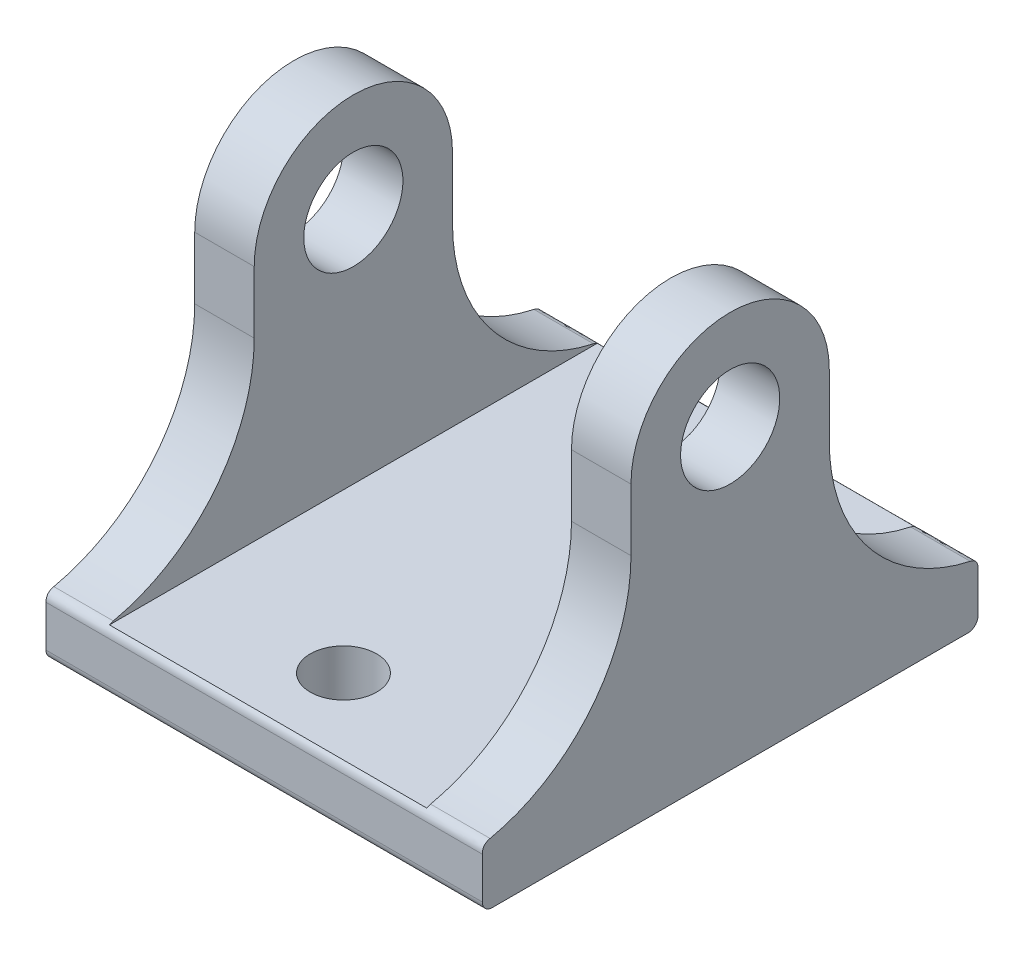
ISO-10303-21;
HEADER;
FILE_DESCRIPTION(('STEP AP214'),'2;1');
FILE_NAME('part.step','',(''),(''),'','','');
FILE_SCHEMA(('AUTOMOTIVE_DESIGN { 1 0 10303 214 1 1 1 1 }'));
ENDSEC;
DATA;
#1=APPLICATION_CONTEXT('core data for automotive mechanical design processes');
#2=APPLICATION_PROTOCOL_DEFINITION('international standard','automotive_design',2000,#1);
#3=PRODUCT_CONTEXT('',#1,'mechanical');
#4=PRODUCT('Part','Part','',(#3));
#5=PRODUCT_RELATED_PRODUCT_CATEGORY('part','',(#4));
#6=PRODUCT_DEFINITION_FORMATION('','',#4);
#7=PRODUCT_DEFINITION_CONTEXT('part definition',#1,'design');
#8=PRODUCT_DEFINITION('design','',#6,#7);
#9=PRODUCT_DEFINITION_SHAPE('','',#8);
#10=(LENGTH_UNIT() NAMED_UNIT(*) SI_UNIT(.MILLI.,.METRE.));
#11=(NAMED_UNIT(*) PLANE_ANGLE_UNIT() SI_UNIT($,.RADIAN.));
#12=(NAMED_UNIT(*) SI_UNIT($,.STERADIAN.) SOLID_ANGLE_UNIT());
#13=UNCERTAINTY_MEASURE_WITH_UNIT(LENGTH_MEASURE(1.E-05),#10,'distance_accuracy_value','');
#14=(GEOMETRIC_REPRESENTATION_CONTEXT(3) GLOBAL_UNCERTAINTY_ASSIGNED_CONTEXT((#13)) GLOBAL_UNIT_ASSIGNED_CONTEXT((#10,
#11,#12)) REPRESENTATION_CONTEXT('',''));
#15=CARTESIAN_POINT('',(0.,0.,0.));
#16=DIRECTION('',(0.,0.,1.));
#17=DIRECTION('',(1.,0.,0.));
#18=AXIS2_PLACEMENT_3D('',#15,#16,#17);
#19=CARTESIAN_POINT('',(22.,6.,25.));
#20=DIRECTION('',(-1.,0.,0.));
#21=DIRECTION('',(0.,0.,1.));
#22=AXIS2_PLACEMENT_3D('',#19,#20,#21);
#23=PLANE('',#22);
#24=CARTESIAN_POINT('',(22.,30.,0.));
#25=DIRECTION('',(-1.,0.,0.));
#26=DIRECTION('',(0.,0.,1.));
#27=AXIS2_PLACEMENT_3D('',#24,#25,#26);
#28=CIRCLE('',#27,5.);
#29=CARTESIAN_POINT('',(22.,30.,5.));
#30=VERTEX_POINT('',#29);
#31=EDGE_CURVE('E525',#30,#30,#28,.T.);
#32=ORIENTED_EDGE('',*,*,#31,.T.);
#33=EDGE_LOOP('',(#32));
#34=FACE_BOUND('',#33,.T.);
#35=DIRECTION('',(0.,-1.,0.));
#36=VECTOR('',#35,1.);
#37=CARTESIAN_POINT('',(22.,6.,-25.));
#38=LINE('',#37,#36);
#39=CARTESIAN_POINT('',(22.,5.17406372829214,-25.));
#40=VERTEX_POINT('',#39);
#41=CARTESIAN_POINT('',(22.,1.,-25.));
#42=VERTEX_POINT('',#41);
#43=EDGE_CURVE('E327',#40,#42,#38,.T.);
#44=ORIENTED_EDGE('',*,*,#43,.F.);
#45=CARTESIAN_POINT('',(22.,6.15165191887144,-24.2105263157895));
#46=CARTESIAN_POINT('',(22.,5.98163658137939,-25.));
#47=CARTESIAN_POINT('',(22.,5.17406372829214,-25.));
#48=(BOUNDED_CURVE() B_SPLINE_CURVE(2,(#45,#46,#47),.UNSPECIFIED.,.F.,
.F.) B_SPLINE_CURVE_WITH_KNOTS((3,3),(0.,1.),
.UNSPECIFIED.) CURVE() GEOMETRIC_REPRESENTATION_ITEM() RATIONAL_B_SPLINE_CURVE((1.,1.,1.)) REPRESENTATION_ITEM(''));
#49=CARTESIAN_POINT('',(22.,6.15165191887144,-24.2105263157895));
#50=VERTEX_POINT('',#49);
#51=EDGE_CURVE('E526',#40,#50,#48,.F.);
#52=ORIENTED_EDGE('',*,*,#51,.T.);
#53=CARTESIAN_POINT('',(22.,23.7482393492988,-28.));
#54=DIRECTION('',(-1.,0.,0.));
#55=DIRECTION('',(0.,0.,1.));
#56=AXIS2_PLACEMENT_3D('',#53,#54,#55);
#57=CIRCLE('',#56,18.);
#58=CARTESIAN_POINT('',(22.,23.7482393492988,-10.));
#59=VERTEX_POINT('',#58);
#60=EDGE_CURVE('E426',#50,#59,#57,.T.);
#61=ORIENTED_EDGE('',*,*,#60,.T.);
#62=DIRECTION('',(0.,-1.,0.));
#63=VECTOR('',#62,1.);
#64=CARTESIAN_POINT('',(22.,30.,-10.));
#65=LINE('',#64,#63);
#66=CARTESIAN_POINT('',(22.,30.,-10.));
#67=VERTEX_POINT('',#66);
#68=EDGE_CURVE('E214',#67,#59,#65,.T.);
#69=ORIENTED_EDGE('',*,*,#68,.F.);
#70=CARTESIAN_POINT('',(22.,30.,0.));
#71=DIRECTION('',(-1.,0.,0.));
#72=DIRECTION('',(0.,0.,-1.));
#73=AXIS2_PLACEMENT_3D('',#70,#71,#72);
#74=CIRCLE('',#73,10.);
#75=CARTESIAN_POINT('',(22.,30.,10.));
#76=VERTEX_POINT('',#75);
#77=EDGE_CURVE('E198',#76,#67,#74,.T.);
#78=ORIENTED_EDGE('',*,*,#77,.F.);
#79=DIRECTION('',(0.,-1.,0.));
#80=VECTOR('',#79,1.);
#81=CARTESIAN_POINT('',(22.,30.,10.));
#82=LINE('',#81,#80);
#83=CARTESIAN_POINT('',(22.,23.7482393492988,10.));
#84=VERTEX_POINT('',#83);
#85=EDGE_CURVE('E208',#76,#84,#82,.T.);
#86=ORIENTED_EDGE('',*,*,#85,.T.);
#87=CARTESIAN_POINT('',(22.,23.7482393492988,28.));
#88=DIRECTION('',(-1.,0.,0.));
#89=DIRECTION('',(0.,0.,1.));
#90=AXIS2_PLACEMENT_3D('',#87,#88,#89);
#91=CIRCLE('',#90,18.);
#92=CARTESIAN_POINT('',(22.,6.15165191887144,24.2105263157895));
#93=VERTEX_POINT('',#92);
#94=EDGE_CURVE('E237',#84,#93,#91,.T.);
#95=ORIENTED_EDGE('',*,*,#94,.T.);
#96=CARTESIAN_POINT('',(22.,5.17406372829214,25.));
#97=CARTESIAN_POINT('',(22.,5.98163658137939,25.));
#98=CARTESIAN_POINT('',(22.,6.15165191887144,24.2105263157895));
#99=(BOUNDED_CURVE() B_SPLINE_CURVE(2,(#96,#97,#98),.UNSPECIFIED.,.F.,
.F.) B_SPLINE_CURVE_WITH_KNOTS((3,3),(0.,1.),
.UNSPECIFIED.) CURVE() GEOMETRIC_REPRESENTATION_ITEM() RATIONAL_B_SPLINE_CURVE((1.,1.,1.)) REPRESENTATION_ITEM(''));
#100=CARTESIAN_POINT('',(22.,5.17406372829214,25.));
#101=VERTEX_POINT('',#100);
#102=EDGE_CURVE('E598',#93,#101,#99,.F.);
#103=ORIENTED_EDGE('',*,*,#102,.T.);
#104=DIRECTION('',(0.,-1.,0.));
#105=VECTOR('',#104,1.);
#106=CARTESIAN_POINT('',(22.,6.,25.));
#107=LINE('',#106,#105);
#108=CARTESIAN_POINT('',(22.,1.,25.));
#109=VERTEX_POINT('',#108);
#110=EDGE_CURVE('E256',#101,#109,#107,.T.);
#111=ORIENTED_EDGE('',*,*,#110,.T.);
#112=CARTESIAN_POINT('',(22.,1.,24.));
#113=DIRECTION('',(-1.,0.,0.));
#114=DIRECTION('',(0.,0.,1.));
#115=AXIS2_PLACEMENT_3D('',#112,#113,#114);
#116=CIRCLE('',#115,1.);
#117=CARTESIAN_POINT('',(22.,0.,24.));
#118=VERTEX_POINT('',#117);
#119=EDGE_CURVE('E451',#109,#118,#116,.F.);
#120=ORIENTED_EDGE('',*,*,#119,.T.);
#121=DIRECTION('',(0.,0.,-1.));
#122=VECTOR('',#121,1.);
#123=CARTESIAN_POINT('',(22.,0.,25.));
#124=LINE('',#123,#122);
#125=CARTESIAN_POINT('',(22.,0.,-24.));
#126=VERTEX_POINT('',#125);
#127=EDGE_CURVE('E480',#118,#126,#124,.T.);
#128=ORIENTED_EDGE('',*,*,#127,.T.);
#129=CARTESIAN_POINT('',(22.,1.,-24.));
#130=DIRECTION('',(-1.,0.,0.));
#131=DIRECTION('',(0.,0.,1.));
#132=AXIS2_PLACEMENT_3D('',#129,#130,#131);
#133=CIRCLE('',#132,1.);
#134=EDGE_CURVE('E448',#126,#42,#133,.F.);
#135=ORIENTED_EDGE('',*,*,#134,.T.);
#136=EDGE_LOOP('',(#44,#52,#61,#69,#78,#86,#95,#103,#111,#120,#128,#135));
#137=FACE_BOUND('',#136,.T.);
#138=ADVANCED_FACE('F41',(#34,#137),#23,.F.);
#139=CARTESIAN_POINT('',(-22.,6.,-25.));
#140=DIRECTION('',(0.,0.,1.));
#141=DIRECTION('',(1.,0.,0.));
#142=AXIS2_PLACEMENT_3D('',#139,#140,#141);
#143=PLANE('',#142);
#144=DIRECTION('',(0.,-1.,0.));
#145=VECTOR('',#144,1.);
#146=CARTESIAN_POINT('',(-22.,6.,-25.));
#147=LINE('',#146,#145);
#148=CARTESIAN_POINT('',(-22.,5.17406372829214,-25.));
#149=VERTEX_POINT('',#148);
#150=CARTESIAN_POINT('',(-22.,1.,-25.));
#151=VERTEX_POINT('',#150);
#152=EDGE_CURVE('E273',#149,#151,#147,.T.);
#153=ORIENTED_EDGE('',*,*,#152,.F.);
#154=CARTESIAN_POINT('',(24.2,5.17406372829214,-25.));
#155=CARTESIAN_POINT('',(8.06666666666665,5.17406372829214,-25.));
#156=CARTESIAN_POINT('',(-8.06666666666666,5.17406372829214,-25.));
#157=CARTESIAN_POINT('',(-24.2,5.17406372829214,-25.));
#158=(BOUNDED_CURVE() B_SPLINE_CURVE(3,(#154,#155,#156,#157),.UNSPECIFIED.,.F.,
.F.) B_SPLINE_CURVE_WITH_KNOTS((4,4),(-0.0242,0.0242),
.UNSPECIFIED.) CURVE() GEOMETRIC_REPRESENTATION_ITEM() RATIONAL_B_SPLINE_CURVE((1.,1.,1.,1.)) REPRESENTATION_ITEM(''));
#159=EDGE_CURVE('E530',#149,#40,#158,.F.);
#160=ORIENTED_EDGE('',*,*,#159,.T.);
#161=ORIENTED_EDGE('',*,*,#43,.T.);
#162=DIRECTION('',(-1.,0.,0.));
#163=VECTOR('',#162,1.);
#164=CARTESIAN_POINT('',(-22.,1.,-25.));
#165=LINE('',#164,#163);
#166=EDGE_CURVE('E247',#42,#151,#165,.T.);
#167=ORIENTED_EDGE('',*,*,#166,.T.);
#168=EDGE_LOOP('',(#153,#160,#161,#167));
#169=FACE_BOUND('',#168,.T.);
#170=ADVANCED_FACE('F408',(#169),#143,.F.);
#171=CARTESIAN_POINT('',(-22.,6.,25.));
#172=DIRECTION('',(1.,0.,0.));
#173=DIRECTION('',(0.,0.,-1.));
#174=AXIS2_PLACEMENT_3D('',#171,#172,#173);
#175=PLANE('',#174);
#176=CARTESIAN_POINT('',(-22.,23.7482393492988,-28.));
#177=DIRECTION('',(1.,0.,0.));
#178=DIRECTION('',(0.,0.,-1.));
#179=AXIS2_PLACEMENT_3D('',#176,#177,#178);
#180=CIRCLE('',#179,18.);
#181=CARTESIAN_POINT('',(-22.,23.7482393492988,-10.));
#182=VERTEX_POINT('',#181);
#183=CARTESIAN_POINT('',(-22.,6.15165191887144,-24.2105263157895));
#184=VERTEX_POINT('',#183);
#185=EDGE_CURVE('E279',#182,#184,#180,.T.);
#186=ORIENTED_EDGE('',*,*,#185,.T.);
#187=CARTESIAN_POINT('',(-22.,5.17406372829214,-25.));
#188=CARTESIAN_POINT('',(-22.,5.98163658137939,-25.));
#189=CARTESIAN_POINT('',(-22.,6.15165191887144,-24.2105263157895));
#190=(BOUNDED_CURVE() B_SPLINE_CURVE(2,(#187,#188,#189),.UNSPECIFIED.,.F.,
.F.) B_SPLINE_CURVE_WITH_KNOTS((3,3),(0.,1.),
.UNSPECIFIED.) CURVE() GEOMETRIC_REPRESENTATION_ITEM() RATIONAL_B_SPLINE_CURVE((1.,1.,1.)) REPRESENTATION_ITEM(''));
#191=EDGE_CURVE('E596',#184,#149,#190,.F.);
#192=ORIENTED_EDGE('',*,*,#191,.T.);
#193=ORIENTED_EDGE('',*,*,#152,.T.);
#194=CARTESIAN_POINT('',(-22.,1.,-24.));
#195=DIRECTION('',(1.,0.,0.));
#196=DIRECTION('',(0.,0.,-1.));
#197=AXIS2_PLACEMENT_3D('',#194,#195,#196);
#198=CIRCLE('',#197,1.);
#199=CARTESIAN_POINT('',(-22.,0.,-24.));
#200=VERTEX_POINT('',#199);
#201=EDGE_CURVE('E459',#151,#200,#198,.F.);
#202=ORIENTED_EDGE('',*,*,#201,.T.);
#203=DIRECTION('',(0.,0.,1.));
#204=VECTOR('',#203,1.);
#205=CARTESIAN_POINT('',(-22.,0.,25.));
#206=LINE('',#205,#204);
#207=CARTESIAN_POINT('',(-22.,0.,24.));
#208=VERTEX_POINT('',#207);
#209=EDGE_CURVE('E260',#200,#208,#206,.T.);
#210=ORIENTED_EDGE('',*,*,#209,.T.);
#211=CARTESIAN_POINT('',(-22.,1.,24.));
#212=DIRECTION('',(1.,0.,0.));
#213=DIRECTION('',(0.,0.,-1.));
#214=AXIS2_PLACEMENT_3D('',#211,#212,#213);
#215=CIRCLE('',#214,1.);
#216=CARTESIAN_POINT('',(-22.,1.,25.));
#217=VERTEX_POINT('',#216);
#218=EDGE_CURVE('E460',#208,#217,#215,.F.);
#219=ORIENTED_EDGE('',*,*,#218,.T.);
#220=DIRECTION('',(0.,-1.,0.));
#221=VECTOR('',#220,1.);
#222=CARTESIAN_POINT('',(-22.,6.,25.));
#223=LINE('',#222,#221);
#224=CARTESIAN_POINT('',(-22.,5.17406372829214,25.));
#225=VERTEX_POINT('',#224);
#226=EDGE_CURVE('E259',#225,#217,#223,.T.);
#227=ORIENTED_EDGE('',*,*,#226,.F.);
#228=CARTESIAN_POINT('',(-22.,6.15165191887144,24.2105263157895));
#229=CARTESIAN_POINT('',(-22.,5.98163658137939,25.));
#230=CARTESIAN_POINT('',(-22.,5.17406372829214,25.));
#231=(BOUNDED_CURVE() B_SPLINE_CURVE(2,(#228,#229,#230),.UNSPECIFIED.,.F.,
.F.) B_SPLINE_CURVE_WITH_KNOTS((3,3),(0.,1.),
.UNSPECIFIED.) CURVE() GEOMETRIC_REPRESENTATION_ITEM() RATIONAL_B_SPLINE_CURVE((1.,1.,1.)) REPRESENTATION_ITEM(''));
#232=CARTESIAN_POINT('',(-22.,6.15165191887144,24.2105263157895));
#233=VERTEX_POINT('',#232);
#234=EDGE_CURVE('E443',#225,#233,#231,.F.);
#235=ORIENTED_EDGE('',*,*,#234,.T.);
#236=CARTESIAN_POINT('',(-22.,23.7482393492988,28.));
#237=DIRECTION('',(1.,0.,0.));
#238=DIRECTION('',(0.,0.,-1.));
#239=AXIS2_PLACEMENT_3D('',#236,#237,#238);
#240=CIRCLE('',#239,18.);
#241=CARTESIAN_POINT('',(-22.,23.7482393492988,10.));
#242=VERTEX_POINT('',#241);
#243=EDGE_CURVE('E275',#233,#242,#240,.T.);
#244=ORIENTED_EDGE('',*,*,#243,.T.);
#245=DIRECTION('',(0.,-1.,0.));
#246=VECTOR('',#245,1.);
#247=CARTESIAN_POINT('',(-22.,30.,10.));
#248=LINE('',#247,#246);
#249=CARTESIAN_POINT('',(-22.,30.,10.));
#250=VERTEX_POINT('',#249);
#251=EDGE_CURVE('E483',#250,#242,#248,.T.);
#252=ORIENTED_EDGE('',*,*,#251,.F.);
#253=CARTESIAN_POINT('',(-22.,30.,0.));
#254=DIRECTION('',(-1.,0.,0.));
#255=DIRECTION('',(0.,0.,-1.));
#256=AXIS2_PLACEMENT_3D('',#253,#254,#255);
#257=CIRCLE('',#256,10.);
#258=CARTESIAN_POINT('',(-22.,30.,-10.));
#259=VERTEX_POINT('',#258);
#260=EDGE_CURVE('E690',#250,#259,#257,.T.);
#261=ORIENTED_EDGE('',*,*,#260,.T.);
#262=DIRECTION('',(0.,-1.,0.));
#263=VECTOR('',#262,1.);
#264=CARTESIAN_POINT('',(-22.,30.,-10.));
#265=LINE('',#264,#263);
#266=EDGE_CURVE('E488',#259,#182,#265,.T.);
#267=ORIENTED_EDGE('',*,*,#266,.T.);
#268=EDGE_LOOP('',(#186,#192,#193,#202,#210,#219,#227,#235,#244,#252,#261,#267));
#269=FACE_BOUND('',#268,.T.);
#270=CARTESIAN_POINT('',(-22.,30.,0.));
#271=DIRECTION('',(-1.,0.,0.));
#272=DIRECTION('',(0.,0.,1.));
#273=AXIS2_PLACEMENT_3D('',#270,#271,#272);
#274=CIRCLE('',#273,5.);
#275=CARTESIAN_POINT('',(-22.,30.,5.));
#276=VERTEX_POINT('',#275);
#277=EDGE_CURVE('E197',#276,#276,#274,.T.);
#278=ORIENTED_EDGE('',*,*,#277,.F.);
#279=EDGE_LOOP('',(#278));
#280=FACE_BOUND('',#279,.T.);
#281=ADVANCED_FACE('F404',(#269,#280),#175,.F.);
#282=CARTESIAN_POINT('',(-22.,6.,25.));
#283=DIRECTION('',(0.,0.,-1.));
#284=DIRECTION('',(-1.,0.,0.));
#285=AXIS2_PLACEMENT_3D('',#282,#283,#284);
#286=PLANE('',#285);
#287=ORIENTED_EDGE('',*,*,#110,.F.);
#288=CARTESIAN_POINT('',(-24.2,5.17406372829214,25.));
#289=CARTESIAN_POINT('',(-8.06666666666665,5.17406372829214,25.));
#290=CARTESIAN_POINT('',(8.06666666666666,5.17406372829214,25.));
#291=CARTESIAN_POINT('',(24.2,5.17406372829214,25.));
#292=(BOUNDED_CURVE() B_SPLINE_CURVE(3,(#288,#289,#290,#291),.UNSPECIFIED.,.F.,
.F.) B_SPLINE_CURVE_WITH_KNOTS((4,4),(-0.0242,0.0242),
.UNSPECIFIED.) CURVE() GEOMETRIC_REPRESENTATION_ITEM() RATIONAL_B_SPLINE_CURVE((1.,1.,1.,1.)) REPRESENTATION_ITEM(''));
#293=EDGE_CURVE('E12',#101,#225,#292,.F.);
#294=ORIENTED_EDGE('',*,*,#293,.T.);
#295=ORIENTED_EDGE('',*,*,#226,.T.);
#296=DIRECTION('',(1.,0.,0.));
#297=VECTOR('',#296,1.);
#298=CARTESIAN_POINT('',(22.,1.,25.));
#299=LINE('',#298,#297);
#300=EDGE_CURVE('E446',#217,#109,#299,.T.);
#301=ORIENTED_EDGE('',*,*,#300,.T.);
#302=EDGE_LOOP('',(#287,#294,#295,#301));
#303=FACE_BOUND('',#302,.T.);
#304=ADVANCED_FACE('F393',(#303),#286,.F.);
#305=CARTESIAN_POINT('',(0.,6.,0.));
#306=DIRECTION('',(0.,-1.,0.));
#307=DIRECTION('',(0.,0.,-1.));
#308=AXIS2_PLACEMENT_3D('',#305,#306,#307);
#309=PLANE('',#308);
#310=CARTESIAN_POINT('',(0.,6.,-17.));
#311=DIRECTION('',(0.,1.,0.));
#312=DIRECTION('',(0.,0.,1.));
#313=AXIS2_PLACEMENT_3D('',#310,#311,#312);
#314=CIRCLE('',#313,3.350000031);
#315=CARTESIAN_POINT('',(0.,6.,-13.649999969));
#316=VERTEX_POINT('',#315);
#317=EDGE_CURVE('E600',#316,#316,#314,.T.);
#318=ORIENTED_EDGE('',*,*,#317,.F.);
#319=EDGE_LOOP('',(#318));
#320=FACE_BOUND('',#319,.T.);
#321=CARTESIAN_POINT('',(0.,6.,17.));
#322=DIRECTION('',(0.,-1.,0.));
#323=DIRECTION('',(0.,0.,-1.));
#324=AXIS2_PLACEMENT_3D('',#321,#322,#323);
#325=CIRCLE('',#324,3.350000031);
#326=CARTESIAN_POINT('',(0.,6.,13.649999969));
#327=VERTEX_POINT('',#326);
#328=EDGE_CURVE('E702',#327,#327,#325,.T.);
#329=ORIENTED_EDGE('',*,*,#328,.T.);
#330=EDGE_LOOP('',(#329));
#331=FACE_BOUND('',#330,.T.);
#332=DIRECTION('',(0.,0.,-1.));
#333=VECTOR('',#332,1.);
#334=CARTESIAN_POINT('',(16.,6.,0.));
#335=LINE('',#334,#333);
#336=CARTESIAN_POINT('',(16.,6.,24.6011161096643));
#337=VERTEX_POINT('',#336);
#338=CARTESIAN_POINT('',(16.,6.,-24.6011161096658));
#339=VERTEX_POINT('',#338);
#340=EDGE_CURVE('E207',#337,#339,#335,.T.);
#341=ORIENTED_EDGE('',*,*,#340,.T.);
#342=CARTESIAN_POINT('',(-24.2,6.,-24.6011161096658));
#343=CARTESIAN_POINT('',(-8.06666666666666,6.,-24.6011161096658));
#344=CARTESIAN_POINT('',(8.06666666666665,6.,-24.6011161096658));
#345=CARTESIAN_POINT('',(24.2,6.,-24.6011161096658));
#346=(BOUNDED_CURVE() B_SPLINE_CURVE(3,(#342,#343,#344,#345),.UNSPECIFIED.,.F.,
.F.) B_SPLINE_CURVE_WITH_KNOTS((4,4),(-0.0242,0.0242),
.UNSPECIFIED.) CURVE() GEOMETRIC_REPRESENTATION_ITEM() RATIONAL_B_SPLINE_CURVE((1.,1.,1.,1.)) REPRESENTATION_ITEM(''));
#347=CARTESIAN_POINT('',(-16.,6.,-24.6011161096643));
#348=VERTEX_POINT('',#347);
#349=EDGE_CURVE('E591',#339,#348,#346,.F.);
#350=ORIENTED_EDGE('',*,*,#349,.T.);
#351=DIRECTION('',(0.,0.,1.));
#352=VECTOR('',#351,1.);
#353=CARTESIAN_POINT('',(-16.,6.,0.));
#354=LINE('',#353,#352);
#355=CARTESIAN_POINT('',(-16.,6.,24.6011161096658));
#356=VERTEX_POINT('',#355);
#357=EDGE_CURVE('E481',#348,#356,#354,.T.);
#358=ORIENTED_EDGE('',*,*,#357,.T.);
#359=CARTESIAN_POINT('',(24.2,6.,24.6011161096658));
#360=CARTESIAN_POINT('',(8.06666666666666,6.,24.6011161096658));
#361=CARTESIAN_POINT('',(-8.06666666666665,6.,24.6011161096658));
#362=CARTESIAN_POINT('',(-24.2,6.,24.6011161096658));
#363=(BOUNDED_CURVE() B_SPLINE_CURVE(3,(#359,#360,#361,#362),.UNSPECIFIED.,.F.,
.F.) B_SPLINE_CURVE_WITH_KNOTS((4,4),(-0.0242,0.0242),
.UNSPECIFIED.) CURVE() GEOMETRIC_REPRESENTATION_ITEM() RATIONAL_B_SPLINE_CURVE((1.,1.,1.,1.)) REPRESENTATION_ITEM(''));
#364=EDGE_CURVE('E498',#356,#337,#363,.F.);
#365=ORIENTED_EDGE('',*,*,#364,.T.);
#366=EDGE_LOOP('',(#341,#350,#358,#365));
#367=FACE_BOUND('',#366,.T.);
#368=ADVANCED_FACE('F403',(#320,#331,#367),#309,.F.);
#369=CARTESIAN_POINT('',(0.,0.,0.));
#370=DIRECTION('',(0.,-1.,0.));
#371=DIRECTION('',(0.,0.,-1.));
#372=AXIS2_PLACEMENT_3D('',#369,#370,#371);
#373=PLANE('',#372);
#374=CARTESIAN_POINT('',(0.,0.,-17.));
#375=DIRECTION('',(0.,1.,0.));
#376=DIRECTION('',(0.,0.,1.));
#377=AXIS2_PLACEMENT_3D('',#374,#375,#376);
#378=CIRCLE('',#377,3.350000031);
#379=CARTESIAN_POINT('',(0.,0.,-13.649999969));
#380=VERTEX_POINT('',#379);
#381=EDGE_CURVE('E597',#380,#380,#378,.T.);
#382=ORIENTED_EDGE('',*,*,#381,.T.);
#383=EDGE_LOOP('',(#382));
#384=FACE_BOUND('',#383,.T.);
#385=CARTESIAN_POINT('',(0.,0.,17.));
#386=DIRECTION('',(0.,-1.,0.));
#387=DIRECTION('',(0.,0.,-1.));
#388=AXIS2_PLACEMENT_3D('',#385,#386,#387);
#389=CIRCLE('',#388,3.350000031);
#390=CARTESIAN_POINT('',(0.,0.,13.649999969));
#391=VERTEX_POINT('',#390);
#392=EDGE_CURVE('E705',#391,#391,#389,.T.);
#393=ORIENTED_EDGE('',*,*,#392,.F.);
#394=EDGE_LOOP('',(#393));
#395=FACE_BOUND('',#394,.T.);
#396=ORIENTED_EDGE('',*,*,#209,.F.);
#397=DIRECTION('',(-1.,0.,0.));
#398=VECTOR('',#397,1.);
#399=CARTESIAN_POINT('',(22.,0.,-24.));
#400=LINE('',#399,#398);
#401=EDGE_CURVE('E455',#200,#126,#400,.F.);
#402=ORIENTED_EDGE('',*,*,#401,.T.);
#403=ORIENTED_EDGE('',*,*,#127,.F.);
#404=DIRECTION('',(1.,0.,0.));
#405=VECTOR('',#404,1.);
#406=CARTESIAN_POINT('',(-22.,0.,24.));
#407=LINE('',#406,#405);
#408=EDGE_CURVE('E457',#118,#208,#407,.F.);
#409=ORIENTED_EDGE('',*,*,#408,.T.);
#410=EDGE_LOOP('',(#396,#402,#403,#409));
#411=FACE_BOUND('',#410,.T.);
#412=ADVANCED_FACE('F405',(#384,#395,#411),#373,.T.);
#413=CARTESIAN_POINT('',(-22.,30.,10.));
#414=DIRECTION('',(0.,0.,1.));
#415=DIRECTION('',(1.,0.,0.));
#416=AXIS2_PLACEMENT_3D('',#413,#414,#415);
#417=PLANE('',#416);
#418=ORIENTED_EDGE('',*,*,#251,.T.);
#419=DIRECTION('',(-1.,0.,0.));
#420=VECTOR('',#419,1.);
#421=CARTESIAN_POINT('',(-16.,23.7482393492988,10.));
#422=LINE('',#421,#420);
#423=CARTESIAN_POINT('',(-16.,23.7482393492988,10.));
#424=VERTEX_POINT('',#423);
#425=EDGE_CURVE('E337',#242,#424,#422,.F.);
#426=ORIENTED_EDGE('',*,*,#425,.T.);
#427=DIRECTION('',(0.,-1.,0.));
#428=VECTOR('',#427,1.);
#429=CARTESIAN_POINT('',(-16.,30.,10.));
#430=LINE('',#429,#428);
#431=CARTESIAN_POINT('',(-16.,30.,10.));
#432=VERTEX_POINT('',#431);
#433=EDGE_CURVE('E675',#432,#424,#430,.T.);
#434=ORIENTED_EDGE('',*,*,#433,.F.);
#435=DIRECTION('',(-1.,0.,0.));
#436=VECTOR('',#435,1.);
#437=CARTESIAN_POINT('',(-22.,30.,10.));
#438=LINE('',#437,#436);
#439=EDGE_CURVE('E682',#432,#250,#438,.T.);
#440=ORIENTED_EDGE('',*,*,#439,.T.);
#441=EDGE_LOOP('',(#418,#426,#434,#440));
#442=FACE_BOUND('',#441,.T.);
#443=ADVANCED_FACE('F320',(#442),#417,.T.);
#444=CARTESIAN_POINT('',(-16.,30.,10.));
#445=DIRECTION('',(1.,0.,0.));
#446=DIRECTION('',(0.,0.,-1.));
#447=AXIS2_PLACEMENT_3D('',#444,#445,#446);
#448=PLANE('',#447);
#449=CARTESIAN_POINT('',(-16.,30.,0.));
#450=DIRECTION('',(-1.,0.,0.));
#451=DIRECTION('',(0.,0.,1.));
#452=AXIS2_PLACEMENT_3D('',#449,#450,#451);
#453=CIRCLE('',#452,5.);
#454=CARTESIAN_POINT('',(-16.,30.,5.));
#455=VERTEX_POINT('',#454);
#456=EDGE_CURVE('E693',#455,#455,#453,.T.);
#457=ORIENTED_EDGE('',*,*,#456,.T.);
#458=EDGE_LOOP('',(#457));
#459=FACE_BOUND('',#458,.T.);
#460=ORIENTED_EDGE('',*,*,#357,.F.);
#461=CARTESIAN_POINT('',(-16.,6.15165191887144,-24.2105263157895));
#462=CARTESIAN_POINT('',(-16.,5.98163658137939,-25.));
#463=CARTESIAN_POINT('',(-16.,5.17406372829214,-25.));
#464=(BOUNDED_CURVE() B_SPLINE_CURVE(2,(#461,#462,#463),.UNSPECIFIED.,.F.,
.F.) B_SPLINE_CURVE_WITH_KNOTS((3,3),(0.,1.),
.UNSPECIFIED.) CURVE() GEOMETRIC_REPRESENTATION_ITEM() RATIONAL_B_SPLINE_CURVE((1.,1.,1.)) REPRESENTATION_ITEM(''));
#465=CARTESIAN_POINT('',(-16.,6.15165191887144,-24.2105263157895));
#466=VERTEX_POINT('',#465);
#467=EDGE_CURVE('E592',#348,#466,#464,.F.);
#468=ORIENTED_EDGE('',*,*,#467,.T.);
#469=CARTESIAN_POINT('',(-16.,23.7482393492988,-28.));
#470=DIRECTION('',(1.,0.,0.));
#471=DIRECTION('',(0.,0.,-1.));
#472=AXIS2_PLACEMENT_3D('',#469,#470,#471);
#473=CIRCLE('',#472,18.);
#474=CARTESIAN_POINT('',(-16.,23.7482393492988,-10.));
#475=VERTEX_POINT('',#474);
#476=EDGE_CURVE('E338',#466,#475,#473,.F.);
#477=ORIENTED_EDGE('',*,*,#476,.T.);
#478=DIRECTION('',(0.,-1.,0.));
#479=VECTOR('',#478,1.);
#480=CARTESIAN_POINT('',(-16.,30.,-10.));
#481=LINE('',#480,#479);
#482=CARTESIAN_POINT('',(-16.,30.,-10.));
#483=VERTEX_POINT('',#482);
#484=EDGE_CURVE('E678',#483,#475,#481,.T.);
#485=ORIENTED_EDGE('',*,*,#484,.F.);
#486=CARTESIAN_POINT('',(-16.,30.,0.));
#487=DIRECTION('',(-1.,0.,0.));
#488=DIRECTION('',(0.,0.,-1.));
#489=AXIS2_PLACEMENT_3D('',#486,#487,#488);
#490=CIRCLE('',#489,10.);
#491=EDGE_CURVE('E216',#432,#483,#490,.T.);
#492=ORIENTED_EDGE('',*,*,#491,.F.);
#493=ORIENTED_EDGE('',*,*,#433,.T.);
#494=CARTESIAN_POINT('',(-16.,23.7482393492988,28.));
#495=DIRECTION('',(1.,0.,0.));
#496=DIRECTION('',(0.,0.,-1.));
#497=AXIS2_PLACEMENT_3D('',#494,#495,#496);
#498=CIRCLE('',#497,18.);
#499=CARTESIAN_POINT('',(-16.,6.15165191887144,24.2105263157895));
#500=VERTEX_POINT('',#499);
#501=EDGE_CURVE('E278',#424,#500,#498,.F.);
#502=ORIENTED_EDGE('',*,*,#501,.T.);
#503=CARTESIAN_POINT('',(-16.,5.17406372829214,25.));
#504=CARTESIAN_POINT('',(-16.,5.98163658137939,25.));
#505=CARTESIAN_POINT('',(-16.,6.15165191887144,24.2105263157895));
#506=(BOUNDED_CURVE() B_SPLINE_CURVE(2,(#503,#504,#505),.UNSPECIFIED.,.F.,
.F.) B_SPLINE_CURVE_WITH_KNOTS((3,3),(0.,1.),
.UNSPECIFIED.) CURVE() GEOMETRIC_REPRESENTATION_ITEM() RATIONAL_B_SPLINE_CURVE((1.,1.,1.)) REPRESENTATION_ITEM(''));
#507=EDGE_CURVE('E302',#500,#356,#506,.F.);
#508=ORIENTED_EDGE('',*,*,#507,.T.);
#509=EDGE_LOOP('',(#460,#468,#477,#485,#492,#493,#502,#508));
#510=FACE_BOUND('',#509,.T.);
#511=ADVANCED_FACE('F309',(#459,#510),#448,.T.);
#512=CARTESIAN_POINT('',(-16.,30.,-10.));
#513=DIRECTION('',(0.,0.,-1.));
#514=DIRECTION('',(-1.,0.,0.));
#515=AXIS2_PLACEMENT_3D('',#512,#513,#514);
#516=PLANE('',#515);
#517=ORIENTED_EDGE('',*,*,#484,.T.);
#518=DIRECTION('',(1.,0.,0.));
#519=VECTOR('',#518,1.);
#520=CARTESIAN_POINT('',(-22.,23.7482393492988,-10.));
#521=LINE('',#520,#519);
#522=EDGE_CURVE('E333',#475,#182,#521,.F.);
#523=ORIENTED_EDGE('',*,*,#522,.T.);
#524=ORIENTED_EDGE('',*,*,#266,.F.);
#525=DIRECTION('',(1.,0.,0.));
#526=VECTOR('',#525,1.);
#527=CARTESIAN_POINT('',(-16.,30.,-10.));
#528=LINE('',#527,#526);
#529=EDGE_CURVE('E225',#259,#483,#528,.T.);
#530=ORIENTED_EDGE('',*,*,#529,.T.);
#531=EDGE_LOOP('',(#517,#523,#524,#530));
#532=FACE_BOUND('',#531,.T.);
#533=ADVANCED_FACE('F319',(#532),#516,.T.);
#534=CARTESIAN_POINT('',(16.,30.,10.));
#535=DIRECTION('',(-1.,0.,0.));
#536=DIRECTION('',(0.,0.,1.));
#537=AXIS2_PLACEMENT_3D('',#534,#535,#536);
#538=PLANE('',#537);
#539=CARTESIAN_POINT('',(16.,30.,0.));
#540=DIRECTION('',(-1.,0.,0.));
#541=DIRECTION('',(0.,0.,1.));
#542=AXIS2_PLACEMENT_3D('',#539,#540,#541);
#543=CIRCLE('',#542,5.);
#544=CARTESIAN_POINT('',(16.,30.,5.));
#545=VERTEX_POINT('',#544);
#546=EDGE_CURVE('E699',#545,#545,#543,.T.);
#547=ORIENTED_EDGE('',*,*,#546,.F.);
#548=EDGE_LOOP('',(#547));
#549=FACE_BOUND('',#548,.T.);
#550=CARTESIAN_POINT('',(16.,23.7482393492988,-28.));
#551=DIRECTION('',(-1.,0.,0.));
#552=DIRECTION('',(0.,0.,1.));
#553=AXIS2_PLACEMENT_3D('',#550,#551,#552);
#554=CIRCLE('',#553,18.);
#555=CARTESIAN_POINT('',(16.,23.7482393492988,-10.));
#556=VERTEX_POINT('',#555);
#557=CARTESIAN_POINT('',(16.,6.15165191887144,-24.2105263157895));
#558=VERTEX_POINT('',#557);
#559=EDGE_CURVE('E238',#556,#558,#554,.F.);
#560=ORIENTED_EDGE('',*,*,#559,.T.);
#561=CARTESIAN_POINT('',(16.,5.17406372829214,-25.));
#562=CARTESIAN_POINT('',(16.,5.98163658137939,-25.));
#563=CARTESIAN_POINT('',(16.,6.15165191887144,-24.2105263157895));
#564=(BOUNDED_CURVE() B_SPLINE_CURVE(2,(#561,#562,#563),.UNSPECIFIED.,.F.,
.F.) B_SPLINE_CURVE_WITH_KNOTS((3,3),(0.,1.),
.UNSPECIFIED.) CURVE() GEOMETRIC_REPRESENTATION_ITEM() RATIONAL_B_SPLINE_CURVE((1.,1.,1.)) REPRESENTATION_ITEM(''));
#565=EDGE_CURVE('E444',#558,#339,#564,.F.);
#566=ORIENTED_EDGE('',*,*,#565,.T.);
#567=ORIENTED_EDGE('',*,*,#340,.F.);
#568=CARTESIAN_POINT('',(16.,6.15165191887144,24.2105263157895));
#569=CARTESIAN_POINT('',(16.,5.98163658137939,25.));
#570=CARTESIAN_POINT('',(16.,5.17406372829214,25.));
#571=(BOUNDED_CURVE() B_SPLINE_CURVE(2,(#568,#569,#570),.UNSPECIFIED.,.F.,
.F.) B_SPLINE_CURVE_WITH_KNOTS((3,3),(0.,1.),
.UNSPECIFIED.) CURVE() GEOMETRIC_REPRESENTATION_ITEM() RATIONAL_B_SPLINE_CURVE((1.,1.,1.)) REPRESENTATION_ITEM(''));
#572=CARTESIAN_POINT('',(16.,6.15165191887144,24.2105263157895));
#573=VERTEX_POINT('',#572);
#574=EDGE_CURVE('E442',#337,#573,#571,.F.);
#575=ORIENTED_EDGE('',*,*,#574,.T.);
#576=CARTESIAN_POINT('',(16.,23.7482393492988,28.));
#577=DIRECTION('',(-1.,0.,0.));
#578=DIRECTION('',(0.,0.,1.));
#579=AXIS2_PLACEMENT_3D('',#576,#577,#578);
#580=CIRCLE('',#579,18.);
#581=CARTESIAN_POINT('',(16.,23.7482393492988,10.));
#582=VERTEX_POINT('',#581);
#583=EDGE_CURVE('E204',#573,#582,#580,.F.);
#584=ORIENTED_EDGE('',*,*,#583,.T.);
#585=DIRECTION('',(0.,-1.,0.));
#586=VECTOR('',#585,1.);
#587=CARTESIAN_POINT('',(16.,30.,10.));
#588=LINE('',#587,#586);
#589=CARTESIAN_POINT('',(16.,30.,10.));
#590=VERTEX_POINT('',#589);
#591=EDGE_CURVE('E201',#590,#582,#588,.T.);
#592=ORIENTED_EDGE('',*,*,#591,.F.);
#593=CARTESIAN_POINT('',(16.,30.,0.));
#594=DIRECTION('',(-1.,0.,0.));
#595=DIRECTION('',(0.,0.,-1.));
#596=AXIS2_PLACEMENT_3D('',#593,#594,#595);
#597=CIRCLE('',#596,10.);
#598=CARTESIAN_POINT('',(16.,30.,-10.));
#599=VERTEX_POINT('',#598);
#600=EDGE_CURVE('E186',#590,#599,#597,.T.);
#601=ORIENTED_EDGE('',*,*,#600,.T.);
#602=DIRECTION('',(0.,-1.,0.));
#603=VECTOR('',#602,1.);
#604=CARTESIAN_POINT('',(16.,30.,-10.));
#605=LINE('',#604,#603);
#606=EDGE_CURVE('E212',#599,#556,#605,.T.);
#607=ORIENTED_EDGE('',*,*,#606,.T.);
#608=EDGE_LOOP('',(#560,#566,#567,#575,#584,#592,#601,#607));
#609=FACE_BOUND('',#608,.T.);
#610=ADVANCED_FACE('F203',(#549,#609),#538,.T.);
#611=CARTESIAN_POINT('',(22.,30.,10.));
#612=DIRECTION('',(0.,0.,1.));
#613=DIRECTION('',(1.,0.,0.));
#614=AXIS2_PLACEMENT_3D('',#611,#612,#613);
#615=PLANE('',#614);
#616=ORIENTED_EDGE('',*,*,#591,.T.);
#617=DIRECTION('',(-1.,0.,0.));
#618=VECTOR('',#617,1.);
#619=CARTESIAN_POINT('',(22.,23.7482393492988,10.));
#620=LINE('',#619,#618);
#621=EDGE_CURVE('E427',#582,#84,#620,.F.);
#622=ORIENTED_EDGE('',*,*,#621,.T.);
#623=ORIENTED_EDGE('',*,*,#85,.F.);
#624=DIRECTION('',(-1.,0.,0.));
#625=VECTOR('',#624,1.);
#626=CARTESIAN_POINT('',(22.,30.,10.));
#627=LINE('',#626,#625);
#628=EDGE_CURVE('E190',#76,#590,#627,.T.);
#629=ORIENTED_EDGE('',*,*,#628,.T.);
#630=EDGE_LOOP('',(#616,#622,#623,#629));
#631=FACE_BOUND('',#630,.T.);
#632=ADVANCED_FACE('F210',(#631),#615,.T.);
#633=CARTESIAN_POINT('',(16.,30.,-10.));
#634=DIRECTION('',(0.,0.,-1.));
#635=DIRECTION('',(-1.,0.,0.));
#636=AXIS2_PLACEMENT_3D('',#633,#634,#635);
#637=PLANE('',#636);
#638=ORIENTED_EDGE('',*,*,#68,.T.);
#639=DIRECTION('',(1.,0.,0.));
#640=VECTOR('',#639,1.);
#641=CARTESIAN_POINT('',(16.,23.7482393492988,-10.));
#642=LINE('',#641,#640);
#643=EDGE_CURVE('E288',#59,#556,#642,.F.);
#644=ORIENTED_EDGE('',*,*,#643,.T.);
#645=ORIENTED_EDGE('',*,*,#606,.F.);
#646=DIRECTION('',(1.,0.,0.));
#647=VECTOR('',#646,1.);
#648=CARTESIAN_POINT('',(16.,30.,-10.));
#649=LINE('',#648,#647);
#650=EDGE_CURVE('E193',#599,#67,#649,.T.);
#651=ORIENTED_EDGE('',*,*,#650,.T.);
#652=EDGE_LOOP('',(#638,#644,#645,#651));
#653=FACE_BOUND('',#652,.T.);
#654=ADVANCED_FACE('F431',(#653),#637,.T.);
#655=CARTESIAN_POINT('',(-16.,30.,0.));
#656=DIRECTION('',(-1.,0.,0.));
#657=DIRECTION('',(0.,0.,1.));
#658=AXIS2_PLACEMENT_3D('',#655,#656,#657);
#659=CYLINDRICAL_SURFACE('',#658,10.);
#660=ORIENTED_EDGE('',*,*,#260,.F.);
#661=ORIENTED_EDGE('',*,*,#439,.F.);
#662=ORIENTED_EDGE('',*,*,#491,.T.);
#663=ORIENTED_EDGE('',*,*,#529,.F.);
#664=EDGE_LOOP('',(#660,#661,#662,#663));
#665=FACE_BOUND('',#664,.T.);
#666=ADVANCED_FACE('F689',(#665),#659,.T.);
#667=CARTESIAN_POINT('',(-16.,30.,0.));
#668=DIRECTION('',(-1.,0.,0.));
#669=DIRECTION('',(0.,0.,1.));
#670=AXIS2_PLACEMENT_3D('',#667,#668,#669);
#671=CYLINDRICAL_SURFACE('',#670,5.);
#672=ORIENTED_EDGE('',*,*,#456,.F.);
#673=EDGE_LOOP('',(#672));
#674=FACE_BOUND('',#673,.T.);
#675=ORIENTED_EDGE('',*,*,#277,.T.);
#676=EDGE_LOOP('',(#675));
#677=FACE_BOUND('',#676,.T.);
#678=ADVANCED_FACE('F364',(#674,#677),#671,.F.);
#679=CARTESIAN_POINT('',(0.,23.7482393492988,-28.));
#680=DIRECTION('',(-1.,0.,0.));
#681=DIRECTION('',(0.,0.,1.));
#682=AXIS2_PLACEMENT_3D('',#679,#680,#681);
#683=CYLINDRICAL_SURFACE('',#682,18.);
#684=ORIENTED_EDGE('',*,*,#476,.F.);
#685=CARTESIAN_POINT('',(-24.2,6.15165191887144,-24.2105263157895));
#686=CARTESIAN_POINT('',(-8.06666666666666,6.15165191887144,-24.2105263157895));
#687=CARTESIAN_POINT('',(8.06666666666665,6.15165191887144,-24.2105263157895));
#688=CARTESIAN_POINT('',(24.2,6.15165191887144,-24.2105263157895));
#689=(BOUNDED_CURVE() B_SPLINE_CURVE(3,(#685,#686,#687,#688),.UNSPECIFIED.,.F.,
.F.) B_SPLINE_CURVE_WITH_KNOTS((4,4),(-0.0242,0.0242),
.UNSPECIFIED.) CURVE() GEOMETRIC_REPRESENTATION_ITEM() RATIONAL_B_SPLINE_CURVE((1.,1.,1.,1.)) REPRESENTATION_ITEM(''));
#690=EDGE_CURVE('E348',#466,#184,#689,.F.);
#691=ORIENTED_EDGE('',*,*,#690,.T.);
#692=ORIENTED_EDGE('',*,*,#185,.F.);
#693=ORIENTED_EDGE('',*,*,#522,.F.);
#694=EDGE_LOOP('',(#684,#691,#692,#693));
#695=FACE_BOUND('',#694,.T.);
#696=ADVANCED_FACE('F353',(#695),#683,.F.);
#697=CARTESIAN_POINT('',(0.,23.7482393492988,28.));
#698=DIRECTION('',(1.,0.,0.));
#699=DIRECTION('',(0.,0.,-1.));
#700=AXIS2_PLACEMENT_3D('',#697,#698,#699);
#701=CYLINDRICAL_SURFACE('',#700,18.);
#702=ORIENTED_EDGE('',*,*,#243,.F.);
#703=CARTESIAN_POINT('',(24.2,6.15165191887144,24.2105263157895));
#704=CARTESIAN_POINT('',(8.06666666666666,6.15165191887144,24.2105263157895));
#705=CARTESIAN_POINT('',(-8.06666666666665,6.15165191887144,24.2105263157895));
#706=CARTESIAN_POINT('',(-24.2,6.15165191887144,24.2105263157895));
#707=(BOUNDED_CURVE() B_SPLINE_CURVE(3,(#703,#704,#705,#706),.UNSPECIFIED.,.F.,
.F.) B_SPLINE_CURVE_WITH_KNOTS((4,4),(-0.0242,0.0242),
.UNSPECIFIED.) CURVE() GEOMETRIC_REPRESENTATION_ITEM() RATIONAL_B_SPLINE_CURVE((1.,1.,1.,1.)) REPRESENTATION_ITEM(''));
#708=EDGE_CURVE('E55',#233,#500,#707,.F.);
#709=ORIENTED_EDGE('',*,*,#708,.T.);
#710=ORIENTED_EDGE('',*,*,#501,.F.);
#711=ORIENTED_EDGE('',*,*,#425,.F.);
#712=EDGE_LOOP('',(#702,#709,#710,#711));
#713=FACE_BOUND('',#712,.T.);
#714=ADVANCED_FACE('F363',(#713),#701,.F.);
#715=CARTESIAN_POINT('',(16.,30.,0.));
#716=DIRECTION('',(1.,0.,0.));
#717=DIRECTION('',(0.,0.,-1.));
#718=AXIS2_PLACEMENT_3D('',#715,#716,#717);
#719=CYLINDRICAL_SURFACE('',#718,10.);
#720=ORIENTED_EDGE('',*,*,#77,.T.);
#721=ORIENTED_EDGE('',*,*,#650,.F.);
#722=ORIENTED_EDGE('',*,*,#600,.F.);
#723=ORIENTED_EDGE('',*,*,#628,.F.);
#724=EDGE_LOOP('',(#720,#721,#722,#723));
#725=FACE_BOUND('',#724,.T.);
#726=ADVANCED_FACE('F188',(#725),#719,.T.);
#727=CARTESIAN_POINT('',(16.,30.,0.));
#728=DIRECTION('',(1.,0.,0.));
#729=DIRECTION('',(0.,0.,-1.));
#730=AXIS2_PLACEMENT_3D('',#727,#728,#729);
#731=CYLINDRICAL_SURFACE('',#730,5.);
#732=ORIENTED_EDGE('',*,*,#546,.T.);
#733=EDGE_LOOP('',(#732));
#734=FACE_BOUND('',#733,.T.);
#735=ORIENTED_EDGE('',*,*,#31,.F.);
#736=EDGE_LOOP('',(#735));
#737=FACE_BOUND('',#736,.T.);
#738=ADVANCED_FACE('F731',(#734,#737),#731,.F.);
#739=CARTESIAN_POINT('',(0.,23.7482393492988,-28.));
#740=DIRECTION('',(-1.,0.,0.));
#741=DIRECTION('',(0.,0.,1.));
#742=AXIS2_PLACEMENT_3D('',#739,#740,#741);
#743=CYLINDRICAL_SURFACE('',#742,18.);
#744=ORIENTED_EDGE('',*,*,#60,.F.);
#745=CARTESIAN_POINT('',(-24.2,6.15165191887144,-24.2105263157895));
#746=CARTESIAN_POINT('',(-8.06666666666666,6.15165191887144,-24.2105263157895));
#747=CARTESIAN_POINT('',(8.06666666666665,6.15165191887144,-24.2105263157895));
#748=CARTESIAN_POINT('',(24.2,6.15165191887144,-24.2105263157895));
#749=(BOUNDED_CURVE() B_SPLINE_CURVE(3,(#745,#746,#747,#748),.UNSPECIFIED.,.F.,
.F.) B_SPLINE_CURVE_WITH_KNOTS((4,4),(-0.0242,0.0242),
.UNSPECIFIED.) CURVE() GEOMETRIC_REPRESENTATION_ITEM() RATIONAL_B_SPLINE_CURVE((1.,1.,1.,1.)) REPRESENTATION_ITEM(''));
#750=EDGE_CURVE('E438',#50,#558,#749,.F.);
#751=ORIENTED_EDGE('',*,*,#750,.T.);
#752=ORIENTED_EDGE('',*,*,#559,.F.);
#753=ORIENTED_EDGE('',*,*,#643,.F.);
#754=EDGE_LOOP('',(#744,#751,#752,#753));
#755=FACE_BOUND('',#754,.T.);
#756=ADVANCED_FACE('F369',(#755),#743,.F.);
#757=CARTESIAN_POINT('',(0.,23.7482393492988,28.));
#758=DIRECTION('',(1.,0.,0.));
#759=DIRECTION('',(0.,0.,-1.));
#760=AXIS2_PLACEMENT_3D('',#757,#758,#759);
#761=CYLINDRICAL_SURFACE('',#760,18.);
#762=ORIENTED_EDGE('',*,*,#583,.F.);
#763=CARTESIAN_POINT('',(24.2,6.15165191887144,24.2105263157895));
#764=CARTESIAN_POINT('',(8.06666666666666,6.15165191887144,24.2105263157895));
#765=CARTESIAN_POINT('',(-8.06666666666665,6.15165191887144,24.2105263157895));
#766=CARTESIAN_POINT('',(-24.2,6.15165191887144,24.2105263157895));
#767=(BOUNDED_CURVE() B_SPLINE_CURVE(3,(#763,#764,#765,#766),.UNSPECIFIED.,.F.,
.F.) B_SPLINE_CURVE_WITH_KNOTS((4,4),(-0.0242,0.0242),
.UNSPECIFIED.) CURVE() GEOMETRIC_REPRESENTATION_ITEM() RATIONAL_B_SPLINE_CURVE((1.,1.,1.,1.)) REPRESENTATION_ITEM(''));
#768=EDGE_CURVE('E68',#573,#93,#767,.F.);
#769=ORIENTED_EDGE('',*,*,#768,.T.);
#770=ORIENTED_EDGE('',*,*,#94,.F.);
#771=ORIENTED_EDGE('',*,*,#621,.F.);
#772=EDGE_LOOP('',(#762,#769,#770,#771));
#773=FACE_BOUND('',#772,.T.);
#774=ADVANCED_FACE('F722',(#773),#761,.F.);
#775=CARTESIAN_POINT('',(0.,6.,17.));
#776=DIRECTION('',(0.,-1.,0.));
#777=DIRECTION('',(0.,0.,-1.));
#778=AXIS2_PLACEMENT_3D('',#775,#776,#777);
#779=CYLINDRICAL_SURFACE('',#778,3.350000031);
#780=ORIENTED_EDGE('',*,*,#328,.F.);
#781=EDGE_LOOP('',(#780));
#782=FACE_BOUND('',#781,.T.);
#783=ORIENTED_EDGE('',*,*,#392,.T.);
#784=EDGE_LOOP('',(#783));
#785=FACE_BOUND('',#784,.T.);
#786=ADVANCED_FACE('F715',(#782,#785),#779,.F.);
#787=CARTESIAN_POINT('',(0.,6.,-17.));
#788=DIRECTION('',(0.,-1.,0.));
#789=DIRECTION('',(0.,0.,-1.));
#790=AXIS2_PLACEMENT_3D('',#787,#788,#789);
#791=CYLINDRICAL_SURFACE('',#790,3.350000031);
#792=ORIENTED_EDGE('',*,*,#317,.T.);
#793=EDGE_LOOP('',(#792));
#794=FACE_BOUND('',#793,.T.);
#795=ORIENTED_EDGE('',*,*,#381,.F.);
#796=EDGE_LOOP('',(#795));
#797=FACE_BOUND('',#796,.T.);
#798=ADVANCED_FACE('F712',(#794,#797),#791,.F.);
#799=CARTESIAN_POINT('',(-22.,1.,-24.));
#800=DIRECTION('',(1.,0.,0.));
#801=DIRECTION('',(0.,0.,-1.));
#802=AXIS2_PLACEMENT_3D('',#799,#800,#801);
#803=CYLINDRICAL_SURFACE('',#802,1.);
#804=ORIENTED_EDGE('',*,*,#134,.F.);
#805=ORIENTED_EDGE('',*,*,#401,.F.);
#806=ORIENTED_EDGE('',*,*,#201,.F.);
#807=ORIENTED_EDGE('',*,*,#166,.F.);
#808=EDGE_LOOP('',(#804,#805,#806,#807));
#809=FACE_BOUND('',#808,.T.);
#810=ADVANCED_FACE('F472',(#809),#803,.T.);
#811=CARTESIAN_POINT('',(-22.,1.,24.));
#812=DIRECTION('',(-1.,0.,0.));
#813=DIRECTION('',(0.,0.,1.));
#814=AXIS2_PLACEMENT_3D('',#811,#812,#813);
#815=CYLINDRICAL_SURFACE('',#814,1.);
#816=ORIENTED_EDGE('',*,*,#218,.F.);
#817=ORIENTED_EDGE('',*,*,#408,.F.);
#818=ORIENTED_EDGE('',*,*,#119,.F.);
#819=ORIENTED_EDGE('',*,*,#300,.F.);
#820=EDGE_LOOP('',(#816,#817,#818,#819));
#821=FACE_BOUND('',#820,.T.);
#822=ADVANCED_FACE('F552',(#821),#815,.T.);
#823=CARTESIAN_POINT('',(24.2,6.15165191887144,-24.2105263157895));
#824=CARTESIAN_POINT('',(8.06666666666665,6.15165191887144,-24.2105263157895));
#825=CARTESIAN_POINT('',(-8.06666666666666,6.15165191887144,-24.2105263157895));
#826=CARTESIAN_POINT('',(-24.2,6.15165191887144,-24.2105263157895));
#827=CARTESIAN_POINT('',(24.2,5.98163658137939,-25.));
#828=CARTESIAN_POINT('',(8.06666666666665,5.98163658137939,-25.));
#829=CARTESIAN_POINT('',(-8.06666666666666,5.98163658137939,-25.));
#830=CARTESIAN_POINT('',(-24.2,5.98163658137939,-25.));
#831=CARTESIAN_POINT('',(24.2,5.17406372829214,-25.));
#832=CARTESIAN_POINT('',(8.06666666666665,5.17406372829214,-25.));
#833=CARTESIAN_POINT('',(-8.06666666666666,5.17406372829214,-25.));
#834=CARTESIAN_POINT('',(-24.2,5.17406372829214,-25.));
#835=(BOUNDED_SURFACE() B_SPLINE_SURFACE(2,3,((#823,#824,#825,#826),(#827,#828,#829,#830),(#831,
#832,#833,#834)),.UNSPECIFIED.,.F.,.F.,.F.) B_SPLINE_SURFACE_WITH_KNOTS((3,3),(4,4),(0.,1.),
(-0.0242,0.0242),.UNSPECIFIED.) GEOMETRIC_REPRESENTATION_ITEM() RATIONAL_B_SPLINE_SURFACE(((1.,
1.,1.,1.),(1.,1.,1.,1.),(1.,1.,1.,1.))) REPRESENTATION_ITEM('') SURFACE());
#836=ORIENTED_EDGE('',*,*,#191,.F.);
#837=ORIENTED_EDGE('',*,*,#690,.F.);
#838=ORIENTED_EDGE('',*,*,#467,.F.);
#839=ORIENTED_EDGE('',*,*,#349,.F.);
#840=ORIENTED_EDGE('',*,*,#565,.F.);
#841=ORIENTED_EDGE('',*,*,#750,.F.);
#842=ORIENTED_EDGE('',*,*,#51,.F.);
#843=ORIENTED_EDGE('',*,*,#159,.F.);
#844=EDGE_LOOP('',(#836,#837,#838,#839,#840,#841,#842,#843));
#845=FACE_BOUND('',#844,.T.);
#846=ADVANCED_FACE('F529',(#845),#835,.T.);
#847=CARTESIAN_POINT('',(-24.2,6.15165191887144,24.2105263157895));
#848=CARTESIAN_POINT('',(-8.06666666666665,6.15165191887144,24.2105263157895));
#849=CARTESIAN_POINT('',(8.06666666666666,6.15165191887144,24.2105263157895));
#850=CARTESIAN_POINT('',(24.2,6.15165191887144,24.2105263157895));
#851=CARTESIAN_POINT('',(-24.2,5.98163658137939,25.));
#852=CARTESIAN_POINT('',(-8.06666666666665,5.98163658137939,25.));
#853=CARTESIAN_POINT('',(8.06666666666666,5.98163658137939,25.));
#854=CARTESIAN_POINT('',(24.2,5.98163658137939,25.));
#855=CARTESIAN_POINT('',(-24.2,5.17406372829214,25.));
#856=CARTESIAN_POINT('',(-8.06666666666665,5.17406372829214,25.));
#857=CARTESIAN_POINT('',(8.06666666666666,5.17406372829214,25.));
#858=CARTESIAN_POINT('',(24.2,5.17406372829214,25.));
#859=(BOUNDED_SURFACE() B_SPLINE_SURFACE(2,3,((#847,#848,#849,#850),(#851,#852,#853,#854),(#855,
#856,#857,#858)),.UNSPECIFIED.,.F.,.F.,.F.) B_SPLINE_SURFACE_WITH_KNOTS((3,3),(4,4),(0.,1.),
(-0.0242,0.0242),.UNSPECIFIED.) GEOMETRIC_REPRESENTATION_ITEM() RATIONAL_B_SPLINE_SURFACE(((1.,
1.,1.,1.),(1.,1.,1.,1.),(1.,1.,1.,1.))) REPRESENTATION_ITEM('') SURFACE());
#860=ORIENTED_EDGE('',*,*,#102,.F.);
#861=ORIENTED_EDGE('',*,*,#768,.F.);
#862=ORIENTED_EDGE('',*,*,#574,.F.);
#863=ORIENTED_EDGE('',*,*,#364,.F.);
#864=ORIENTED_EDGE('',*,*,#507,.F.);
#865=ORIENTED_EDGE('',*,*,#708,.F.);
#866=ORIENTED_EDGE('',*,*,#234,.F.);
#867=ORIENTED_EDGE('',*,*,#293,.F.);
#868=EDGE_LOOP('',(#860,#861,#862,#863,#864,#865,#866,#867));
#869=FACE_BOUND('',#868,.T.);
#870=ADVANCED_FACE('F44',(#869),#859,.T.);
#871=CLOSED_SHELL('',(#138,#170,#281,#304,#368,#412,#443,#511,#533,#610,#632,#654,#666,#678,
#696,#714,#726,#738,#756,#774,#786,#798,#810,#822,#846,#870));
#872=MANIFOLD_SOLID_BREP('B2',#871);
#873=ADVANCED_BREP_SHAPE_REPRESENTATION('',(#18,#872),#14);
#874=SHAPE_DEFINITION_REPRESENTATION(#9,#873);
ENDSEC;
END-ISO-10303-21;
